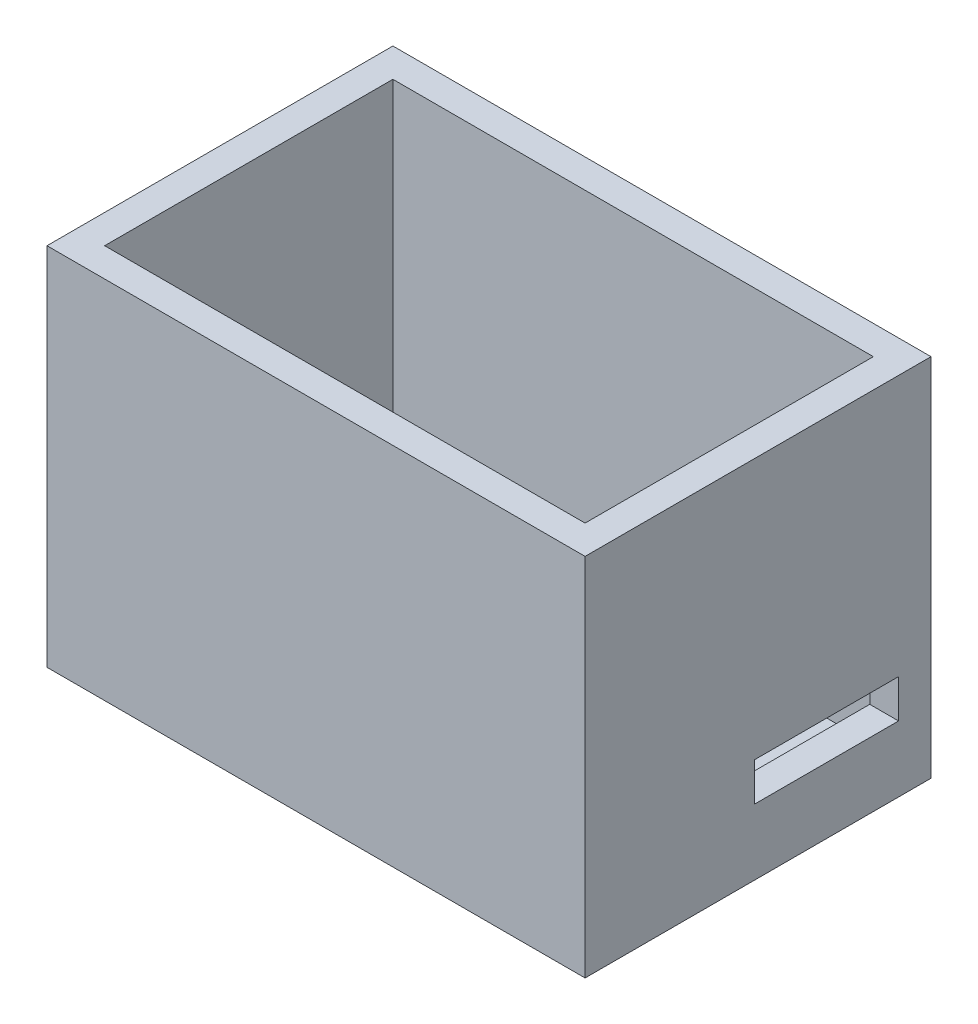
ISO-10303-21;
HEADER;
FILE_DESCRIPTION(('STEP AP214'),'2;1');
FILE_NAME('part.step','',(''),(''),'','','');
FILE_SCHEMA(('AUTOMOTIVE_DESIGN { 1 0 10303 214 1 1 1 1 }'));
ENDSEC;
DATA;
#1=APPLICATION_CONTEXT('core data for automotive mechanical design processes');
#2=APPLICATION_PROTOCOL_DEFINITION('international standard','automotive_design',2000,#1);
#3=PRODUCT_CONTEXT('',#1,'mechanical');
#4=PRODUCT('Part','Part','',(#3));
#5=PRODUCT_RELATED_PRODUCT_CATEGORY('part','',(#4));
#6=PRODUCT_DEFINITION_FORMATION('','',#4);
#7=PRODUCT_DEFINITION_CONTEXT('part definition',#1,'design');
#8=PRODUCT_DEFINITION('design','',#6,#7);
#9=PRODUCT_DEFINITION_SHAPE('','',#8);
#10=(LENGTH_UNIT() NAMED_UNIT(*) SI_UNIT(.MILLI.,.METRE.));
#11=(NAMED_UNIT(*) PLANE_ANGLE_UNIT() SI_UNIT($,.RADIAN.));
#12=(NAMED_UNIT(*) SI_UNIT($,.STERADIAN.) SOLID_ANGLE_UNIT());
#13=UNCERTAINTY_MEASURE_WITH_UNIT(LENGTH_MEASURE(1.E-05),#10,'distance_accuracy_value','');
#14=(GEOMETRIC_REPRESENTATION_CONTEXT(3) GLOBAL_UNCERTAINTY_ASSIGNED_CONTEXT((#13)) GLOBAL_UNIT_ASSIGNED_CONTEXT((#10,
#11,#12)) REPRESENTATION_CONTEXT('',''));
#15=CARTESIAN_POINT('',(0.,0.,0.));
#16=DIRECTION('',(0.,0.,1.));
#17=DIRECTION('',(1.,0.,0.));
#18=AXIS2_PLACEMENT_3D('',#15,#16,#17);
#19=CARTESIAN_POINT('',(-63.335240137142,35.,-26.6560452457744));
#20=DIRECTION('',(1.,0.,0.));
#21=DIRECTION('',(0.,0.,-1.));
#22=AXIS2_PLACEMENT_3D('',#19,#20,#21);
#23=PLANE('',#22);
#24=DIRECTION('',(0.,0.,1.));
#25=VECTOR('',#24,1.);
#26=CARTESIAN_POINT('',(-63.335240137142,-3.,-26.6560452457744));
#27=LINE('',#26,#25);
#28=CARTESIAN_POINT('',(-63.335240137142,-3.,-29.6560452457744));
#29=VERTEX_POINT('',#28);
#30=CARTESIAN_POINT('',(-63.335240137142,-3.,6.34395475422562));
#31=VERTEX_POINT('',#30);
#32=EDGE_CURVE('E179',#29,#31,#27,.T.);
#33=ORIENTED_EDGE('',*,*,#32,.T.);
#34=DIRECTION('',(0.,-1.,0.));
#35=VECTOR('',#34,1.);
#36=CARTESIAN_POINT('',(-63.335240137142,35.,6.34395475422562));
#37=LINE('',#36,#35);
#38=CARTESIAN_POINT('',(-63.335240137142,35.,6.34395475422562));
#39=VERTEX_POINT('',#38);
#40=EDGE_CURVE('E183',#39,#31,#37,.T.);
#41=ORIENTED_EDGE('',*,*,#40,.F.);
#42=DIRECTION('',(0.,0.,1.));
#43=VECTOR('',#42,1.);
#44=CARTESIAN_POINT('',(-63.335240137142,35.,-26.6560452457744));
#45=LINE('',#44,#43);
#46=CARTESIAN_POINT('',(-63.335240137142,35.,-29.6560452457744));
#47=VERTEX_POINT('',#46);
#48=EDGE_CURVE('E202',#47,#39,#45,.T.);
#49=ORIENTED_EDGE('',*,*,#48,.F.);
#50=DIRECTION('',(0.,-1.,0.));
#51=VECTOR('',#50,1.);
#52=CARTESIAN_POINT('',(-63.335240137142,35.,-29.6560452457744));
#53=LINE('',#52,#51);
#54=EDGE_CURVE('E188',#47,#29,#53,.T.);
#55=ORIENTED_EDGE('',*,*,#54,.T.);
#56=EDGE_LOOP('',(#33,#41,#49,#55));
#57=FACE_BOUND('',#56,.T.);
#58=ADVANCED_FACE('F33',(#57),#23,.F.);
#59=CARTESIAN_POINT('',(-60.335240137142,35.,6.34395475422562));
#60=DIRECTION('',(0.,0.,-1.));
#61=DIRECTION('',(-1.,0.,0.));
#62=AXIS2_PLACEMENT_3D('',#59,#60,#61);
#63=PLANE('',#62);
#64=DIRECTION('',(1.,0.,0.));
#65=VECTOR('',#64,1.);
#66=CARTESIAN_POINT('',(-60.335240137142,-3.,6.34395475422562));
#67=LINE('',#66,#65);
#68=CARTESIAN_POINT('',(-7.33524013714198,-3.,6.34395475422562));
#69=VERTEX_POINT('',#68);
#70=EDGE_CURVE('E182',#31,#69,#67,.T.);
#71=ORIENTED_EDGE('',*,*,#70,.T.);
#72=DIRECTION('',(0.,-1.,0.));
#73=VECTOR('',#72,1.);
#74=CARTESIAN_POINT('',(-7.33524013714198,35.,6.34395475422563));
#75=LINE('',#74,#73);
#76=CARTESIAN_POINT('',(-7.33524013714198,35.,6.34395475422562));
#77=VERTEX_POINT('',#76);
#78=EDGE_CURVE('E187',#77,#69,#75,.T.);
#79=ORIENTED_EDGE('',*,*,#78,.F.);
#80=DIRECTION('',(1.,0.,0.));
#81=VECTOR('',#80,1.);
#82=CARTESIAN_POINT('',(-60.335240137142,35.,6.34395475422562));
#83=LINE('',#82,#81);
#84=EDGE_CURVE('E205',#39,#77,#83,.T.);
#85=ORIENTED_EDGE('',*,*,#84,.F.);
#86=ORIENTED_EDGE('',*,*,#40,.T.);
#87=EDGE_LOOP('',(#71,#79,#85,#86));
#88=FACE_BOUND('',#87,.T.);
#89=ADVANCED_FACE('F291',(#88),#63,.F.);
#90=CARTESIAN_POINT('',(-7.33524013714199,35.,-26.6560452457744));
#91=DIRECTION('',(-1.,0.,0.));
#92=DIRECTION('',(0.,0.,1.));
#93=AXIS2_PLACEMENT_3D('',#90,#91,#92);
#94=PLANE('',#93);
#95=DIRECTION('',(0.,0.,1.));
#96=VECTOR('',#95,1.);
#97=CARTESIAN_POINT('',(-7.33524013714199,7.85280337125397,-26.2814614927286));
#98=LINE('',#97,#96);
#99=CARTESIAN_POINT('',(-7.33524013714199,7.85280337125397,-26.2814614927286));
#100=VERTEX_POINT('',#99);
#101=CARTESIAN_POINT('',(-7.33524013714199,7.85280337125397,-11.2814614927286));
#102=VERTEX_POINT('',#101);
#103=EDGE_CURVE('E133',#100,#102,#98,.T.);
#104=ORIENTED_EDGE('',*,*,#103,.F.);
#105=DIRECTION('',(0.,1.,0.));
#106=VECTOR('',#105,1.);
#107=CARTESIAN_POINT('',(-7.33524013714199,7.85280337125397,-26.2814614927286));
#108=LINE('',#107,#106);
#109=CARTESIAN_POINT('',(-7.33524013714199,3.85280337125397,-26.2814614927286));
#110=VERTEX_POINT('',#109);
#111=EDGE_CURVE('E48',#110,#100,#108,.T.);
#112=ORIENTED_EDGE('',*,*,#111,.F.);
#113=DIRECTION('',(0.,0.,-1.));
#114=VECTOR('',#113,1.);
#115=CARTESIAN_POINT('',(-7.33524013714199,3.85280337125397,-26.2814614927286));
#116=LINE('',#115,#114);
#117=CARTESIAN_POINT('',(-7.33524013714199,3.85280337125397,-11.2814614927286));
#118=VERTEX_POINT('',#117);
#119=EDGE_CURVE('E140',#118,#110,#116,.T.);
#120=ORIENTED_EDGE('',*,*,#119,.F.);
#121=DIRECTION('',(0.,-1.,0.));
#122=VECTOR('',#121,1.);
#123=CARTESIAN_POINT('',(-7.33524013714199,7.85280337125397,-11.2814614927286));
#124=LINE('',#123,#122);
#125=EDGE_CURVE('E124',#102,#118,#124,.T.);
#126=ORIENTED_EDGE('',*,*,#125,.F.);
#127=EDGE_LOOP('',(#104,#112,#120,#126));
#128=FACE_BOUND('',#127,.T.);
#129=DIRECTION('',(0.,0.,-1.));
#130=VECTOR('',#129,1.);
#131=CARTESIAN_POINT('',(-7.33524013714199,-3.,-26.6560452457744));
#132=LINE('',#131,#130);
#133=CARTESIAN_POINT('',(-7.33524013714199,-3.,-29.6560452457744));
#134=VERTEX_POINT('',#133);
#135=EDGE_CURVE('E194',#69,#134,#132,.T.);
#136=ORIENTED_EDGE('',*,*,#135,.T.);
#137=DIRECTION('',(0.,-1.,0.));
#138=VECTOR('',#137,1.);
#139=CARTESIAN_POINT('',(-7.33524013714199,35.,-29.6560452457744));
#140=LINE('',#139,#138);
#141=CARTESIAN_POINT('',(-7.33524013714199,35.,-29.6560452457744));
#142=VERTEX_POINT('',#141);
#143=EDGE_CURVE('E191',#142,#134,#140,.T.);
#144=ORIENTED_EDGE('',*,*,#143,.F.);
#145=DIRECTION('',(0.,0.,-1.));
#146=VECTOR('',#145,1.);
#147=CARTESIAN_POINT('',(-7.33524013714199,35.,-26.6560452457744));
#148=LINE('',#147,#146);
#149=EDGE_CURVE('E207',#77,#142,#148,.T.);
#150=ORIENTED_EDGE('',*,*,#149,.F.);
#151=ORIENTED_EDGE('',*,*,#78,.T.);
#152=EDGE_LOOP('',(#136,#144,#150,#151));
#153=FACE_BOUND('',#152,.T.);
#154=ADVANCED_FACE('F137',(#128,#153),#94,.F.);
#155=CARTESIAN_POINT('',(-60.335240137142,35.,-29.6560452457744));
#156=DIRECTION('',(0.,0.,1.));
#157=DIRECTION('',(1.,0.,0.));
#158=AXIS2_PLACEMENT_3D('',#155,#156,#157);
#159=PLANE('',#158);
#160=DIRECTION('',(-1.,0.,0.));
#161=VECTOR('',#160,1.);
#162=CARTESIAN_POINT('',(-60.335240137142,-3.,-29.6560452457744));
#163=LINE('',#162,#161);
#164=EDGE_CURVE('E198',#134,#29,#163,.T.);
#165=ORIENTED_EDGE('',*,*,#164,.T.);
#166=ORIENTED_EDGE('',*,*,#54,.F.);
#167=DIRECTION('',(-1.,0.,0.));
#168=VECTOR('',#167,1.);
#169=CARTESIAN_POINT('',(-60.335240137142,35.,-29.6560452457744));
#170=LINE('',#169,#168);
#171=EDGE_CURVE('E192',#142,#47,#170,.T.);
#172=ORIENTED_EDGE('',*,*,#171,.F.);
#173=ORIENTED_EDGE('',*,*,#143,.T.);
#174=EDGE_LOOP('',(#165,#166,#172,#173));
#175=FACE_BOUND('',#174,.T.);
#176=ADVANCED_FACE('F303',(#175),#159,.F.);
#177=CARTESIAN_POINT('',(0.,35.,0.));
#178=DIRECTION('',(0.,1.,0.));
#179=DIRECTION('',(0.,0.,1.));
#180=AXIS2_PLACEMENT_3D('',#177,#178,#179);
#181=PLANE('',#180);
#182=DIRECTION('',(0.,0.,1.));
#183=VECTOR('',#182,1.);
#184=CARTESIAN_POINT('',(-60.335240137142,35.,-26.6560452457744));
#185=LINE('',#184,#183);
#186=CARTESIAN_POINT('',(-60.335240137142,35.,-26.6560452457744));
#187=VERTEX_POINT('',#186);
#188=CARTESIAN_POINT('',(-60.335240137142,35.,3.34395475422562));
#189=VERTEX_POINT('',#188);
#190=EDGE_CURVE('E150',#187,#189,#185,.T.);
#191=ORIENTED_EDGE('',*,*,#190,.F.);
#192=DIRECTION('',(-1.,0.,0.));
#193=VECTOR('',#192,1.);
#194=CARTESIAN_POINT('',(-60.335240137142,35.,-26.6560452457744));
#195=LINE('',#194,#193);
#196=CARTESIAN_POINT('',(-10.335240137142,35.,-26.6560452457744));
#197=VERTEX_POINT('',#196);
#198=EDGE_CURVE('E158',#197,#187,#195,.T.);
#199=ORIENTED_EDGE('',*,*,#198,.F.);
#200=DIRECTION('',(0.,0.,-1.));
#201=VECTOR('',#200,1.);
#202=CARTESIAN_POINT('',(-10.335240137142,35.,-26.6560452457744));
#203=LINE('',#202,#201);
#204=CARTESIAN_POINT('',(-10.335240137142,35.,3.34395475422562));
#205=VERTEX_POINT('',#204);
#206=EDGE_CURVE('E155',#205,#197,#203,.T.);
#207=ORIENTED_EDGE('',*,*,#206,.F.);
#208=DIRECTION('',(1.,0.,0.));
#209=VECTOR('',#208,1.);
#210=CARTESIAN_POINT('',(-60.335240137142,35.,3.34395475422562));
#211=LINE('',#210,#209);
#212=EDGE_CURVE('E152',#189,#205,#211,.T.);
#213=ORIENTED_EDGE('',*,*,#212,.F.);
#214=EDGE_LOOP('',(#191,#199,#207,#213));
#215=FACE_BOUND('',#214,.T.);
#216=ORIENTED_EDGE('',*,*,#48,.T.);
#217=ORIENTED_EDGE('',*,*,#84,.T.);
#218=ORIENTED_EDGE('',*,*,#149,.T.);
#219=ORIENTED_EDGE('',*,*,#171,.T.);
#220=EDGE_LOOP('',(#216,#217,#218,#219));
#221=FACE_BOUND('',#220,.T.);
#222=ADVANCED_FACE('F279',(#215,#221),#181,.T.);
#223=CARTESIAN_POINT('',(0.,-3.,0.));
#224=DIRECTION('',(0.,1.,0.));
#225=DIRECTION('',(0.,0.,1.));
#226=AXIS2_PLACEMENT_3D('',#223,#224,#225);
#227=PLANE('',#226);
#228=CARTESIAN_POINT('',(-26.4422421066212,-3.,-17.7212471658874));
#229=DIRECTION('',(0.,1.,0.));
#230=DIRECTION('',(0.,0.,-1.));
#231=AXIS2_PLACEMENT_3D('',#228,#229,#230);
#232=CIRCLE('',#231,2.);
#233=CARTESIAN_POINT('',(-26.4422421066212,-3.,-19.7212471658874));
#234=VERTEX_POINT('',#233);
#235=EDGE_CURVE('E237',#234,#234,#232,.T.);
#236=ORIENTED_EDGE('',*,*,#235,.T.);
#237=EDGE_LOOP('',(#236));
#238=FACE_BOUND('',#237,.T.);
#239=CARTESIAN_POINT('',(-26.4422421066212,-3.,-5.59084332566135));
#240=DIRECTION('',(0.,1.,0.));
#241=DIRECTION('',(0.,0.,1.));
#242=AXIS2_PLACEMENT_3D('',#239,#240,#241);
#243=CIRCLE('',#242,2.);
#244=CARTESIAN_POINT('',(-26.4422421066212,-3.,-3.59084332566135));
#245=VERTEX_POINT('',#244);
#246=EDGE_CURVE('E231',#245,#245,#243,.T.);
#247=ORIENTED_EDGE('',*,*,#246,.T.);
#248=EDGE_LOOP('',(#247));
#249=FACE_BOUND('',#248,.T.);
#250=CARTESIAN_POINT('',(-44.2282381676628,-3.,-5.59084332566135));
#251=DIRECTION('',(0.,1.,0.));
#252=DIRECTION('',(0.,0.,-1.));
#253=AXIS2_PLACEMENT_3D('',#250,#251,#252);
#254=CIRCLE('',#253,2.);
#255=CARTESIAN_POINT('',(-44.2282381676628,-3.,-7.59084332566135));
#256=VERTEX_POINT('',#255);
#257=EDGE_CURVE('E226',#256,#256,#254,.T.);
#258=ORIENTED_EDGE('',*,*,#257,.T.);
#259=EDGE_LOOP('',(#258));
#260=FACE_BOUND('',#259,.T.);
#261=CARTESIAN_POINT('',(-44.2282381676628,-3.,-17.7212471658874));
#262=DIRECTION('',(0.,1.,0.));
#263=DIRECTION('',(0.,0.,1.));
#264=AXIS2_PLACEMENT_3D('',#261,#262,#263);
#265=CIRCLE('',#264,2.);
#266=CARTESIAN_POINT('',(-44.2282381676628,-3.,-15.7212471658874));
#267=VERTEX_POINT('',#266);
#268=EDGE_CURVE('E220',#267,#267,#265,.T.);
#269=ORIENTED_EDGE('',*,*,#268,.T.);
#270=EDGE_LOOP('',(#269));
#271=FACE_BOUND('',#270,.T.);
#272=ORIENTED_EDGE('',*,*,#32,.F.);
#273=ORIENTED_EDGE('',*,*,#164,.F.);
#274=ORIENTED_EDGE('',*,*,#135,.F.);
#275=ORIENTED_EDGE('',*,*,#70,.F.);
#276=EDGE_LOOP('',(#272,#273,#274,#275));
#277=FACE_BOUND('',#276,.T.);
#278=ADVANCED_FACE('F35',(#238,#249,#260,#271,#277),#227,.F.);
#279=CARTESIAN_POINT('',(-60.335240137142,35.,-26.6560452457744));
#280=DIRECTION('',(1.,0.,0.));
#281=DIRECTION('',(0.,0.,-1.));
#282=AXIS2_PLACEMENT_3D('',#279,#280,#281);
#283=PLANE('',#282);
#284=DIRECTION('',(0.,0.,1.));
#285=VECTOR('',#284,1.);
#286=CARTESIAN_POINT('',(-60.335240137142,0.,-26.6560452457744));
#287=LINE('',#286,#285);
#288=CARTESIAN_POINT('',(-60.335240137142,0.,-26.6560452457744));
#289=VERTEX_POINT('',#288);
#290=CARTESIAN_POINT('',(-60.335240137142,0.,3.34395475422562));
#291=VERTEX_POINT('',#290);
#292=EDGE_CURVE('E147',#289,#291,#287,.T.);
#293=ORIENTED_EDGE('',*,*,#292,.F.);
#294=DIRECTION('',(0.,-1.,0.));
#295=VECTOR('',#294,1.);
#296=CARTESIAN_POINT('',(-60.335240137142,35.,-26.6560452457744));
#297=LINE('',#296,#295);
#298=EDGE_CURVE('E160',#187,#289,#297,.T.);
#299=ORIENTED_EDGE('',*,*,#298,.F.);
#300=ORIENTED_EDGE('',*,*,#190,.T.);
#301=DIRECTION('',(0.,-1.,0.));
#302=VECTOR('',#301,1.);
#303=CARTESIAN_POINT('',(-60.335240137142,35.,3.34395475422562));
#304=LINE('',#303,#302);
#305=EDGE_CURVE('E176',#189,#291,#304,.T.);
#306=ORIENTED_EDGE('',*,*,#305,.T.);
#307=EDGE_LOOP('',(#293,#299,#300,#306));
#308=FACE_BOUND('',#307,.T.);
#309=ADVANCED_FACE('F270',(#308),#283,.T.);
#310=CARTESIAN_POINT('',(-60.335240137142,35.,3.34395475422562));
#311=DIRECTION('',(0.,0.,-1.));
#312=DIRECTION('',(-1.,0.,0.));
#313=AXIS2_PLACEMENT_3D('',#310,#311,#312);
#314=PLANE('',#313);
#315=DIRECTION('',(1.,0.,0.));
#316=VECTOR('',#315,1.);
#317=CARTESIAN_POINT('',(-60.335240137142,0.,3.34395475422562));
#318=LINE('',#317,#316);
#319=CARTESIAN_POINT('',(-10.335240137142,0.,3.34395475422562));
#320=VERTEX_POINT('',#319);
#321=EDGE_CURVE('E163',#291,#320,#318,.T.);
#322=ORIENTED_EDGE('',*,*,#321,.F.);
#323=ORIENTED_EDGE('',*,*,#305,.F.);
#324=ORIENTED_EDGE('',*,*,#212,.T.);
#325=DIRECTION('',(0.,-1.,0.));
#326=VECTOR('',#325,1.);
#327=CARTESIAN_POINT('',(-10.335240137142,35.,3.34395475422562));
#328=LINE('',#327,#326);
#329=EDGE_CURVE('E173',#205,#320,#328,.T.);
#330=ORIENTED_EDGE('',*,*,#329,.T.);
#331=EDGE_LOOP('',(#322,#323,#324,#330));
#332=FACE_BOUND('',#331,.T.);
#333=ADVANCED_FACE('F275',(#332),#314,.T.);
#334=CARTESIAN_POINT('',(-10.335240137142,35.,-26.6560452457744));
#335=DIRECTION('',(-1.,0.,0.));
#336=DIRECTION('',(0.,0.,1.));
#337=AXIS2_PLACEMENT_3D('',#334,#335,#336);
#338=PLANE('',#337);
#339=DIRECTION('',(0.,-1.,0.));
#340=VECTOR('',#339,1.);
#341=CARTESIAN_POINT('',(-10.335240137142,35.,-26.2814614927286));
#342=LINE('',#341,#340);
#343=CARTESIAN_POINT('',(-10.335240137142,7.85280337125397,-26.2814614927286));
#344=VERTEX_POINT('',#343);
#345=CARTESIAN_POINT('',(-10.335240137142,3.85280337125397,-26.2814614927286));
#346=VERTEX_POINT('',#345);
#347=EDGE_CURVE('E11',#344,#346,#342,.T.);
#348=ORIENTED_EDGE('',*,*,#347,.F.);
#349=DIRECTION('',(0.,0.,-1.));
#350=VECTOR('',#349,1.);
#351=CARTESIAN_POINT('',(-10.335240137142,7.85280337125397,-26.6560452457744));
#352=LINE('',#351,#350);
#353=CARTESIAN_POINT('',(-10.335240137142,7.85280337125397,-11.2814614927286));
#354=VERTEX_POINT('',#353);
#355=EDGE_CURVE('E186',#354,#344,#352,.T.);
#356=ORIENTED_EDGE('',*,*,#355,.F.);
#357=DIRECTION('',(0.,1.,0.));
#358=VECTOR('',#357,1.);
#359=CARTESIAN_POINT('',(-10.335240137142,35.,-11.2814614927286));
#360=LINE('',#359,#358);
#361=CARTESIAN_POINT('',(-10.335240137142,3.85280337125397,-11.2814614927286));
#362=VERTEX_POINT('',#361);
#363=EDGE_CURVE('E127',#362,#354,#360,.T.);
#364=ORIENTED_EDGE('',*,*,#363,.F.);
#365=DIRECTION('',(0.,0.,1.));
#366=VECTOR('',#365,1.);
#367=CARTESIAN_POINT('',(-10.335240137142,3.85280337125397,-26.6560452457744));
#368=LINE('',#367,#366);
#369=EDGE_CURVE('E41',#346,#362,#368,.T.);
#370=ORIENTED_EDGE('',*,*,#369,.F.);
#371=EDGE_LOOP('',(#348,#356,#364,#370));
#372=FACE_BOUND('',#371,.T.);
#373=DIRECTION('',(0.,0.,-1.));
#374=VECTOR('',#373,1.);
#375=CARTESIAN_POINT('',(-10.335240137142,0.,-26.6560452457744));
#376=LINE('',#375,#374);
#377=CARTESIAN_POINT('',(-10.335240137142,0.,-26.6560452457744));
#378=VERTEX_POINT('',#377);
#379=EDGE_CURVE('E165',#320,#378,#376,.T.);
#380=ORIENTED_EDGE('',*,*,#379,.F.);
#381=ORIENTED_EDGE('',*,*,#329,.F.);
#382=ORIENTED_EDGE('',*,*,#206,.T.);
#383=DIRECTION('',(0.,-1.,0.));
#384=VECTOR('',#383,1.);
#385=CARTESIAN_POINT('',(-10.335240137142,35.,-26.6560452457744));
#386=LINE('',#385,#384);
#387=EDGE_CURVE('E170',#197,#378,#386,.T.);
#388=ORIENTED_EDGE('',*,*,#387,.T.);
#389=EDGE_LOOP('',(#380,#381,#382,#388));
#390=FACE_BOUND('',#389,.T.);
#391=ADVANCED_FACE('F217',(#372,#390),#338,.T.);
#392=CARTESIAN_POINT('',(-60.335240137142,35.,-26.6560452457744));
#393=DIRECTION('',(0.,0.,1.));
#394=DIRECTION('',(1.,0.,0.));
#395=AXIS2_PLACEMENT_3D('',#392,#393,#394);
#396=PLANE('',#395);
#397=DIRECTION('',(-1.,0.,0.));
#398=VECTOR('',#397,1.);
#399=CARTESIAN_POINT('',(-60.335240137142,0.,-26.6560452457744));
#400=LINE('',#399,#398);
#401=EDGE_CURVE('E153',#378,#289,#400,.T.);
#402=ORIENTED_EDGE('',*,*,#401,.F.);
#403=ORIENTED_EDGE('',*,*,#387,.F.);
#404=ORIENTED_EDGE('',*,*,#198,.T.);
#405=ORIENTED_EDGE('',*,*,#298,.T.);
#406=EDGE_LOOP('',(#402,#403,#404,#405));
#407=FACE_BOUND('',#406,.T.);
#408=ADVANCED_FACE('F258',(#407),#396,.T.);
#409=CARTESIAN_POINT('',(0.,0.,0.));
#410=DIRECTION('',(0.,1.,0.));
#411=DIRECTION('',(0.,0.,1.));
#412=AXIS2_PLACEMENT_3D('',#409,#410,#411);
#413=PLANE('',#412);
#414=CARTESIAN_POINT('',(-26.4422421066212,0.,-17.7212471658874));
#415=DIRECTION('',(0.,1.,0.));
#416=DIRECTION('',(0.,0.,-1.));
#417=AXIS2_PLACEMENT_3D('',#414,#415,#416);
#418=CIRCLE('',#417,2.);
#419=CARTESIAN_POINT('',(-26.4422421066212,0.,-19.7212471658874));
#420=VERTEX_POINT('',#419);
#421=EDGE_CURVE('E240',#420,#420,#418,.T.);
#422=ORIENTED_EDGE('',*,*,#421,.F.);
#423=EDGE_LOOP('',(#422));
#424=FACE_BOUND('',#423,.T.);
#425=CARTESIAN_POINT('',(-26.4422421066212,0.,-5.59084332566135));
#426=DIRECTION('',(0.,1.,0.));
#427=DIRECTION('',(0.,0.,1.));
#428=AXIS2_PLACEMENT_3D('',#425,#426,#427);
#429=CIRCLE('',#428,2.);
#430=CARTESIAN_POINT('',(-26.4422421066212,0.,-3.59084332566135));
#431=VERTEX_POINT('',#430);
#432=EDGE_CURVE('E234',#431,#431,#429,.T.);
#433=ORIENTED_EDGE('',*,*,#432,.F.);
#434=EDGE_LOOP('',(#433));
#435=FACE_BOUND('',#434,.T.);
#436=CARTESIAN_POINT('',(-44.2282381676628,0.,-5.59084332566135));
#437=DIRECTION('',(0.,1.,0.));
#438=DIRECTION('',(0.,0.,-1.));
#439=AXIS2_PLACEMENT_3D('',#436,#437,#438);
#440=CIRCLE('',#439,2.);
#441=CARTESIAN_POINT('',(-44.2282381676628,0.,-7.59084332566135));
#442=VERTEX_POINT('',#441);
#443=EDGE_CURVE('E228',#442,#442,#440,.T.);
#444=ORIENTED_EDGE('',*,*,#443,.F.);
#445=EDGE_LOOP('',(#444));
#446=FACE_BOUND('',#445,.T.);
#447=CARTESIAN_POINT('',(-44.2282381676628,0.,-17.7212471658874));
#448=DIRECTION('',(0.,1.,0.));
#449=DIRECTION('',(0.,0.,1.));
#450=AXIS2_PLACEMENT_3D('',#447,#448,#449);
#451=CIRCLE('',#450,2.);
#452=CARTESIAN_POINT('',(-44.2282381676628,0.,-15.7212471658874));
#453=VERTEX_POINT('',#452);
#454=EDGE_CURVE('E222',#453,#453,#451,.T.);
#455=ORIENTED_EDGE('',*,*,#454,.F.);
#456=EDGE_LOOP('',(#455));
#457=FACE_BOUND('',#456,.T.);
#458=ORIENTED_EDGE('',*,*,#292,.T.);
#459=ORIENTED_EDGE('',*,*,#321,.T.);
#460=ORIENTED_EDGE('',*,*,#379,.T.);
#461=ORIENTED_EDGE('',*,*,#401,.T.);
#462=EDGE_LOOP('',(#458,#459,#460,#461));
#463=FACE_BOUND('',#462,.T.);
#464=ADVANCED_FACE('F255',(#424,#435,#446,#457,#463),#413,.T.);
#465=CARTESIAN_POINT('',(-42.335240137142,7.85280337125397,-26.2814614927286));
#466=DIRECTION('',(0.,0.,-1.));
#467=DIRECTION('',(-1.,0.,0.));
#468=AXIS2_PLACEMENT_3D('',#465,#466,#467);
#469=PLANE('',#468);
#470=ORIENTED_EDGE('',*,*,#347,.T.);
#471=DIRECTION('',(1.,0.,0.));
#472=VECTOR('',#471,1.);
#473=CARTESIAN_POINT('',(-42.335240137142,3.85280337125397,-26.2814614927286));
#474=LINE('',#473,#472);
#475=EDGE_CURVE('E145',#346,#110,#474,.T.);
#476=ORIENTED_EDGE('',*,*,#475,.T.);
#477=ORIENTED_EDGE('',*,*,#111,.T.);
#478=DIRECTION('',(1.,0.,0.));
#479=VECTOR('',#478,1.);
#480=CARTESIAN_POINT('',(-42.335240137142,7.85280337125397,-26.2814614927286));
#481=LINE('',#480,#479);
#482=EDGE_CURVE('E130',#344,#100,#481,.T.);
#483=ORIENTED_EDGE('',*,*,#482,.F.);
#484=EDGE_LOOP('',(#470,#476,#477,#483));
#485=FACE_BOUND('',#484,.T.);
#486=ADVANCED_FACE('F219',(#485),#469,.F.);
#487=CARTESIAN_POINT('',(-42.335240137142,3.85280337125397,-26.2814614927286));
#488=DIRECTION('',(0.,-1.,0.));
#489=DIRECTION('',(0.,0.,-1.));
#490=AXIS2_PLACEMENT_3D('',#487,#488,#489);
#491=PLANE('',#490);
#492=ORIENTED_EDGE('',*,*,#369,.T.);
#493=DIRECTION('',(1.,0.,0.));
#494=VECTOR('',#493,1.);
#495=CARTESIAN_POINT('',(-42.335240137142,3.85280337125397,-11.2814614927286));
#496=LINE('',#495,#494);
#497=EDGE_CURVE('E129',#362,#118,#496,.T.);
#498=ORIENTED_EDGE('',*,*,#497,.T.);
#499=ORIENTED_EDGE('',*,*,#119,.T.);
#500=ORIENTED_EDGE('',*,*,#475,.F.);
#501=EDGE_LOOP('',(#492,#498,#499,#500));
#502=FACE_BOUND('',#501,.T.);
#503=ADVANCED_FACE('F214',(#502),#491,.F.);
#504=CARTESIAN_POINT('',(-42.335240137142,7.85280337125397,-11.2814614927286));
#505=DIRECTION('',(0.,0.,1.));
#506=DIRECTION('',(1.,0.,0.));
#507=AXIS2_PLACEMENT_3D('',#504,#505,#506);
#508=PLANE('',#507);
#509=ORIENTED_EDGE('',*,*,#363,.T.);
#510=DIRECTION('',(1.,0.,0.));
#511=VECTOR('',#510,1.);
#512=CARTESIAN_POINT('',(-42.335240137142,7.85280337125397,-11.2814614927286));
#513=LINE('',#512,#511);
#514=EDGE_CURVE('E56',#354,#102,#513,.T.);
#515=ORIENTED_EDGE('',*,*,#514,.T.);
#516=ORIENTED_EDGE('',*,*,#125,.T.);
#517=ORIENTED_EDGE('',*,*,#497,.F.);
#518=EDGE_LOOP('',(#509,#515,#516,#517));
#519=FACE_BOUND('',#518,.T.);
#520=ADVANCED_FACE('F121',(#519),#508,.F.);
#521=CARTESIAN_POINT('',(-42.335240137142,7.85280337125397,-26.2814614927286));
#522=DIRECTION('',(0.,1.,0.));
#523=DIRECTION('',(0.,0.,1.));
#524=AXIS2_PLACEMENT_3D('',#521,#522,#523);
#525=PLANE('',#524);
#526=ORIENTED_EDGE('',*,*,#355,.T.);
#527=ORIENTED_EDGE('',*,*,#482,.T.);
#528=ORIENTED_EDGE('',*,*,#103,.T.);
#529=ORIENTED_EDGE('',*,*,#514,.F.);
#530=EDGE_LOOP('',(#526,#527,#528,#529));
#531=FACE_BOUND('',#530,.T.);
#532=ADVANCED_FACE('F134',(#531),#525,.F.);
#533=CARTESIAN_POINT('',(-44.2282381676628,-3.,-17.7212471658874));
#534=DIRECTION('',(0.,1.,0.));
#535=DIRECTION('',(0.,0.,1.));
#536=AXIS2_PLACEMENT_3D('',#533,#534,#535);
#537=CYLINDRICAL_SURFACE('',#536,2.);
#538=ORIENTED_EDGE('',*,*,#268,.F.);
#539=EDGE_LOOP('',(#538));
#540=FACE_BOUND('',#539,.T.);
#541=ORIENTED_EDGE('',*,*,#454,.T.);
#542=EDGE_LOOP('',(#541));
#543=FACE_BOUND('',#542,.T.);
#544=ADVANCED_FACE('F371',(#540,#543),#537,.F.);
#545=CARTESIAN_POINT('',(-44.2282381676628,-3.,-5.59084332566135));
#546=DIRECTION('',(0.,1.,0.));
#547=DIRECTION('',(0.,0.,1.));
#548=AXIS2_PLACEMENT_3D('',#545,#546,#547);
#549=CYLINDRICAL_SURFACE('',#548,2.);
#550=ORIENTED_EDGE('',*,*,#257,.F.);
#551=EDGE_LOOP('',(#550));
#552=FACE_BOUND('',#551,.T.);
#553=ORIENTED_EDGE('',*,*,#443,.T.);
#554=EDGE_LOOP('',(#553));
#555=FACE_BOUND('',#554,.T.);
#556=ADVANCED_FACE('F392',(#552,#555),#549,.F.);
#557=CARTESIAN_POINT('',(-26.4422421066212,-3.,-5.59084332566135));
#558=DIRECTION('',(0.,1.,0.));
#559=DIRECTION('',(0.,0.,1.));
#560=AXIS2_PLACEMENT_3D('',#557,#558,#559);
#561=CYLINDRICAL_SURFACE('',#560,2.);
#562=ORIENTED_EDGE('',*,*,#246,.F.);
#563=EDGE_LOOP('',(#562));
#564=FACE_BOUND('',#563,.T.);
#565=ORIENTED_EDGE('',*,*,#432,.T.);
#566=EDGE_LOOP('',(#565));
#567=FACE_BOUND('',#566,.T.);
#568=ADVANCED_FACE('F251',(#564,#567),#561,.F.);
#569=CARTESIAN_POINT('',(-26.4422421066212,-3.,-17.7212471658874));
#570=DIRECTION('',(0.,1.,0.));
#571=DIRECTION('',(0.,0.,1.));
#572=AXIS2_PLACEMENT_3D('',#569,#570,#571);
#573=CYLINDRICAL_SURFACE('',#572,2.);
#574=ORIENTED_EDGE('',*,*,#235,.F.);
#575=EDGE_LOOP('',(#574));
#576=FACE_BOUND('',#575,.T.);
#577=ORIENTED_EDGE('',*,*,#421,.T.);
#578=EDGE_LOOP('',(#577));
#579=FACE_BOUND('',#578,.T.);
#580=ADVANCED_FACE('F248',(#576,#579),#573,.F.);
#581=CLOSED_SHELL('',(#58,#89,#154,#176,#222,#278,#309,#333,#391,#408,#464,#486,#503,#520,#532,
#544,#556,#568,#580));
#582=MANIFOLD_SOLID_BREP('B2',#581);
#583=ADVANCED_BREP_SHAPE_REPRESENTATION('',(#18,#582),#14);
#584=SHAPE_DEFINITION_REPRESENTATION(#9,#583);
ENDSEC;
END-ISO-10303-21;
